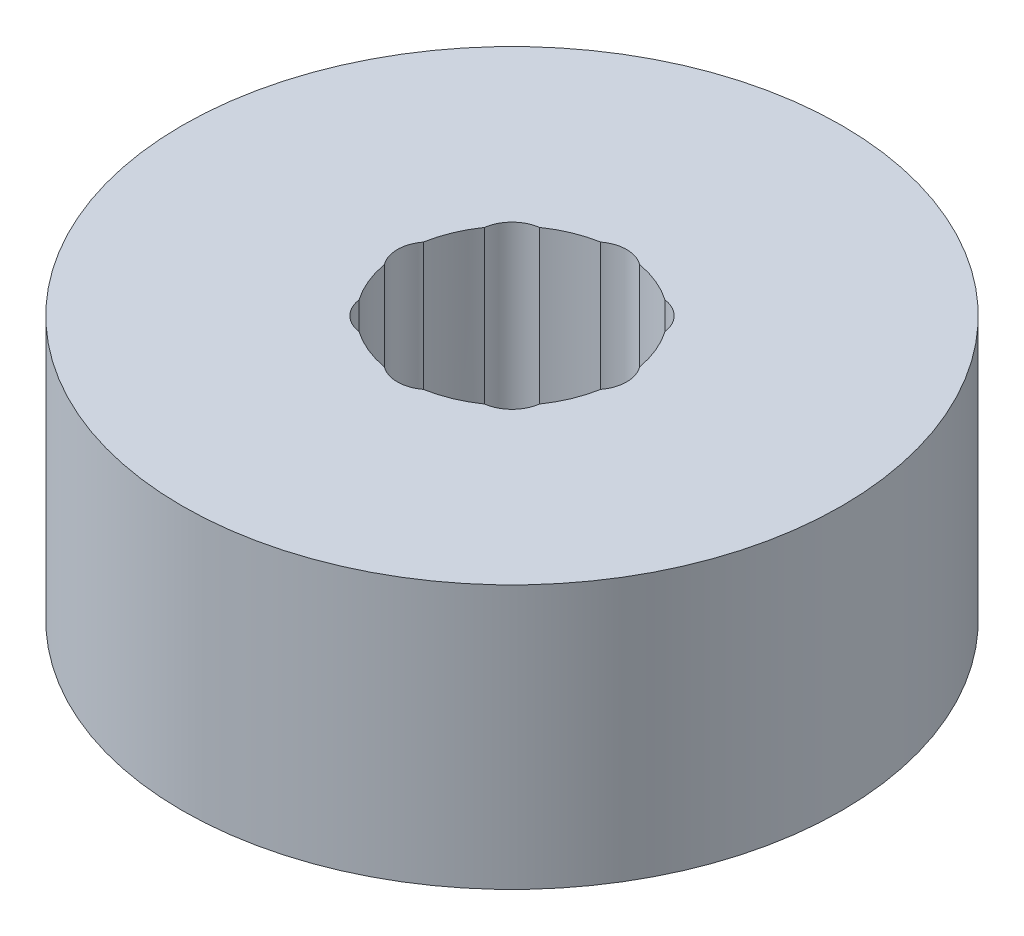
ISO-10303-21;
HEADER;
FILE_DESCRIPTION(('STEP AP214'),'2;1');
FILE_NAME('part.step','',(''),(''),'','','');
FILE_SCHEMA(('AUTOMOTIVE_DESIGN { 1 0 10303 214 1 1 1 1 }'));
ENDSEC;
DATA;
#1=APPLICATION_CONTEXT('core data for automotive mechanical design processes');
#2=APPLICATION_PROTOCOL_DEFINITION('international standard','automotive_design',2000,#1);
#3=PRODUCT_CONTEXT('',#1,'mechanical');
#4=PRODUCT('Part','Part','',(#3));
#5=PRODUCT_RELATED_PRODUCT_CATEGORY('part','',(#4));
#6=PRODUCT_DEFINITION_FORMATION('','',#4);
#7=PRODUCT_DEFINITION_CONTEXT('part definition',#1,'design');
#8=PRODUCT_DEFINITION('design','',#6,#7);
#9=PRODUCT_DEFINITION_SHAPE('','',#8);
#10=(LENGTH_UNIT() NAMED_UNIT(*) SI_UNIT(.MILLI.,.METRE.));
#11=(NAMED_UNIT(*) PLANE_ANGLE_UNIT() SI_UNIT($,.RADIAN.));
#12=(NAMED_UNIT(*) SI_UNIT($,.STERADIAN.) SOLID_ANGLE_UNIT());
#13=UNCERTAINTY_MEASURE_WITH_UNIT(LENGTH_MEASURE(1.E-05),#10,'distance_accuracy_value','');
#14=(GEOMETRIC_REPRESENTATION_CONTEXT(3) GLOBAL_UNCERTAINTY_ASSIGNED_CONTEXT((#13)) GLOBAL_UNIT_ASSIGNED_CONTEXT((#10,
#11,#12)) REPRESENTATION_CONTEXT('',''));
#15=CARTESIAN_POINT('',(0.,0.,0.));
#16=DIRECTION('',(0.,0.,1.));
#17=DIRECTION('',(1.,0.,0.));
#18=AXIS2_PLACEMENT_3D('',#15,#16,#17);
#19=CARTESIAN_POINT('',(0.,18.,0.));
#20=DIRECTION('',(0.,-1.,0.));
#21=DIRECTION('',(0.,0.,-1.));
#22=AXIS2_PLACEMENT_3D('',#19,#20,#21);
#23=CYLINDRICAL_SURFACE('',#22,22.5);
#24=CARTESIAN_POINT('',(0.,18.,0.));
#25=DIRECTION('',(0.,1.,0.));
#26=DIRECTION('',(0.,0.,1.));
#27=AXIS2_PLACEMENT_3D('',#24,#25,#26);
#28=CIRCLE('',#27,22.5);
#29=CARTESIAN_POINT('',(0.,18.,22.5));
#30=VERTEX_POINT('',#29);
#31=EDGE_CURVE('E263',#30,#30,#28,.T.);
#32=ORIENTED_EDGE('',*,*,#31,.F.);
#33=EDGE_LOOP('',(#32));
#34=FACE_BOUND('',#33,.T.);
#35=CARTESIAN_POINT('',(0.,0.,0.));
#36=DIRECTION('',(0.,1.,0.));
#37=DIRECTION('',(0.,0.,1.));
#38=AXIS2_PLACEMENT_3D('',#35,#36,#37);
#39=CIRCLE('',#38,22.5);
#40=CARTESIAN_POINT('',(0.,0.,22.5));
#41=VERTEX_POINT('',#40);
#42=EDGE_CURVE('E256',#41,#41,#39,.T.);
#43=ORIENTED_EDGE('',*,*,#42,.T.);
#44=EDGE_LOOP('',(#43));
#45=FACE_BOUND('',#44,.T.);
#46=ADVANCED_FACE('F39',(#34,#45),#23,.T.);
#47=CARTESIAN_POINT('',(0.,18.,0.));
#48=DIRECTION('',(0.,1.,0.));
#49=DIRECTION('',(0.,0.,1.));
#50=AXIS2_PLACEMENT_3D('',#47,#48,#49);
#51=PLANE('',#50);
#52=CARTESIAN_POINT('',(-3.97389094860852,18.,3.97389094860854));
#53=DIRECTION('',(0.,1.,0.));
#54=DIRECTION('',(0.707106781186549,0.,0.707106781186546));
#55=AXIS2_PLACEMENT_3D('',#52,#53,#54);
#56=CIRCLE('',#55,2.20637313933488);
#57=CARTESIAN_POINT('',(-6.15894220023802,18.,4.27988679454577));
#58=VERTEX_POINT('',#57);
#59=CARTESIAN_POINT('',(-4.27988679454575,18.,6.15894220023803));
#60=VERTEX_POINT('',#59);
#61=EDGE_CURVE('E246',#58,#60,#56,.T.);
#62=ORIENTED_EDGE('',*,*,#61,.F.);
#63=CARTESIAN_POINT('',(0.,18.,0.));
#64=DIRECTION('',(0.,1.,0.));
#65=DIRECTION('',(0.,0.,1.));
#66=AXIS2_PLACEMENT_3D('',#63,#64,#65);
#67=CIRCLE('',#66,7.5);
#68=CARTESIAN_POINT('',(-7.38136676985837,18.,1.32869281959024));
#69=VERTEX_POINT('',#68);
#70=EDGE_CURVE('E254',#69,#58,#67,.T.);
#71=ORIENTED_EDGE('',*,*,#70,.F.);
#72=CARTESIAN_POINT('',(-5.61993047491387,18.,0.));
#73=DIRECTION('',(0.,1.,0.));
#74=DIRECTION('',(0.,0.,1.));
#75=AXIS2_PLACEMENT_3D('',#72,#73,#74);
#76=CIRCLE('',#75,2.20637313933488);
#77=CARTESIAN_POINT('',(-7.38136676985837,18.,-1.32869281959024));
#78=VERTEX_POINT('',#77);
#79=EDGE_CURVE('E248',#78,#69,#76,.T.);
#80=ORIENTED_EDGE('',*,*,#79,.F.);
#81=CARTESIAN_POINT('',(-6.15894220023808,18.,-4.27988679454568));
#82=VERTEX_POINT('',#81);
#83=EDGE_CURVE('E257',#82,#78,#67,.T.);
#84=ORIENTED_EDGE('',*,*,#83,.F.);
#85=CARTESIAN_POINT('',(-3.97389094860858,18.,-3.97389094860848));
#86=DIRECTION('',(0.,1.,0.));
#87=DIRECTION('',(-0.707106781186539,0.,0.707106781186556));
#88=AXIS2_PLACEMENT_3D('',#85,#86,#87);
#89=CIRCLE('',#88,2.20637313933488);
#90=CARTESIAN_POINT('',(-4.27988679454583,18.,-6.15894220023797));
#91=VERTEX_POINT('',#90);
#92=EDGE_CURVE('E58',#91,#82,#89,.T.);
#93=ORIENTED_EDGE('',*,*,#92,.F.);
#94=CARTESIAN_POINT('',(-1.32869281959032,18.,-7.38136676985835));
#95=VERTEX_POINT('',#94);
#96=EDGE_CURVE('E168',#95,#91,#67,.T.);
#97=ORIENTED_EDGE('',*,*,#96,.F.);
#98=CARTESIAN_POINT('',(0.,18.,-5.61993047491387));
#99=DIRECTION('',(0.,1.,0.));
#100=DIRECTION('',(-1.,0.,0.));
#101=AXIS2_PLACEMENT_3D('',#98,#99,#100);
#102=CIRCLE('',#101,2.20637313933488);
#103=CARTESIAN_POINT('',(1.32869281959017,18.,-7.38136676985838));
#104=VERTEX_POINT('',#103);
#105=EDGE_CURVE('E165',#104,#95,#102,.T.);
#106=ORIENTED_EDGE('',*,*,#105,.F.);
#107=CARTESIAN_POINT('',(4.2798867945457,18.,-6.15894220023807));
#108=VERTEX_POINT('',#107);
#109=EDGE_CURVE('E604',#108,#104,#67,.T.);
#110=ORIENTED_EDGE('',*,*,#109,.F.);
#111=CARTESIAN_POINT('',(3.9738909486085,18.,-3.97389094860856));
#112=DIRECTION('',(0.,1.,0.));
#113=DIRECTION('',(-0.707106781186554,0.,-0.707106781186541));
#114=AXIS2_PLACEMENT_3D('',#111,#112,#113);
#115=CIRCLE('',#114,2.20637313933488);
#116=CARTESIAN_POINT('',(6.15894220023799,18.,-4.27988679454581));
#117=VERTEX_POINT('',#116);
#118=EDGE_CURVE('E224',#117,#108,#115,.T.);
#119=ORIENTED_EDGE('',*,*,#118,.F.);
#120=CARTESIAN_POINT('',(7.38136676985837,18.,-1.32869281959024));
#121=VERTEX_POINT('',#120);
#122=EDGE_CURVE('E605',#121,#117,#67,.T.);
#123=ORIENTED_EDGE('',*,*,#122,.F.);
#124=CARTESIAN_POINT('',(5.61993047491387,18.,0.));
#125=DIRECTION('',(0.,1.,0.));
#126=DIRECTION('',(0.,0.,-1.));
#127=AXIS2_PLACEMENT_3D('',#124,#125,#126);
#128=CIRCLE('',#127,2.20637313933488);
#129=CARTESIAN_POINT('',(7.38136676985836,18.,1.32869281959024));
#130=VERTEX_POINT('',#129);
#131=EDGE_CURVE('E231',#130,#121,#128,.T.);
#132=ORIENTED_EDGE('',*,*,#131,.F.);
#133=CARTESIAN_POINT('',(6.15894220023805,18.,4.27988679454573));
#134=VERTEX_POINT('',#133);
#135=EDGE_CURVE('E599',#134,#130,#67,.T.);
#136=ORIENTED_EDGE('',*,*,#135,.F.);
#137=CARTESIAN_POINT('',(3.97389094860855,18.,3.97389094860851));
#138=DIRECTION('',(0.,1.,0.));
#139=DIRECTION('',(0.707106781186544,0.,-0.707106781186551));
#140=AXIS2_PLACEMENT_3D('',#137,#138,#139);
#141=CIRCLE('',#140,2.20637313933488);
#142=CARTESIAN_POINT('',(4.27988679454579,18.,6.158942200238));
#143=VERTEX_POINT('',#142);
#144=EDGE_CURVE('E237',#143,#134,#141,.T.);
#145=ORIENTED_EDGE('',*,*,#144,.F.);
#146=CARTESIAN_POINT('',(1.32869281959027,18.,7.38136676985836));
#147=VERTEX_POINT('',#146);
#148=EDGE_CURVE('E598',#147,#143,#67,.T.);
#149=ORIENTED_EDGE('',*,*,#148,.F.);
#150=CARTESIAN_POINT('',(0.,18.,5.61993047491387));
#151=DIRECTION('',(0.,1.,0.));
#152=DIRECTION('',(1.,0.,0.));
#153=AXIS2_PLACEMENT_3D('',#150,#151,#152);
#154=CIRCLE('',#153,2.20637313933488);
#155=CARTESIAN_POINT('',(-1.32869281959022,18.,7.38136676985837));
#156=VERTEX_POINT('',#155);
#157=EDGE_CURVE('E241',#156,#147,#154,.T.);
#158=ORIENTED_EDGE('',*,*,#157,.F.);
#159=EDGE_CURVE('E259',#60,#156,#67,.T.);
#160=ORIENTED_EDGE('',*,*,#159,.F.);
#161=EDGE_LOOP('',(#62,#71,#80,#84,#93,#97,#106,#110,#119,#123,#132,#136,#145,#149,#158,#160));
#162=FACE_BOUND('',#161,.T.);
#163=ORIENTED_EDGE('',*,*,#31,.T.);
#164=EDGE_LOOP('',(#163));
#165=FACE_BOUND('',#164,.T.);
#166=ADVANCED_FACE('F286',(#162,#165),#51,.T.);
#167=CARTESIAN_POINT('',(0.,0.,0.));
#168=DIRECTION('',(0.,1.,0.));
#169=DIRECTION('',(0.,0.,1.));
#170=AXIS2_PLACEMENT_3D('',#167,#168,#169);
#171=PLANE('',#170);
#172=CARTESIAN_POINT('',(0.,0.,0.));
#173=DIRECTION('',(0.,1.,0.));
#174=DIRECTION('',(0.,0.,1.));
#175=AXIS2_PLACEMENT_3D('',#172,#173,#174);
#176=CIRCLE('',#175,7.5);
#177=CARTESIAN_POINT('',(0.,0.,7.5));
#178=VERTEX_POINT('',#177);
#179=EDGE_CURVE('E251',#178,#178,#176,.T.);
#180=ORIENTED_EDGE('',*,*,#179,.T.);
#181=EDGE_LOOP('',(#180));
#182=FACE_BOUND('',#181,.T.);
#183=ORIENTED_EDGE('',*,*,#42,.F.);
#184=EDGE_LOOP('',(#183));
#185=FACE_BOUND('',#184,.T.);
#186=ADVANCED_FACE('F308',(#182,#185),#171,.F.);
#187=CARTESIAN_POINT('',(0.,18.,0.));
#188=DIRECTION('',(0.,-1.,0.));
#189=DIRECTION('',(0.,0.,-1.));
#190=AXIS2_PLACEMENT_3D('',#187,#188,#189);
#191=CYLINDRICAL_SURFACE('',#190,7.5);
#192=DIRECTION('',(0.,1.,0.));
#193=VECTOR('',#192,1.);
#194=CARTESIAN_POINT('',(-6.15894220023802,11.003877804609,4.27988679454577));
#195=LINE('',#194,#193);
#196=CARTESIAN_POINT('',(-6.15894220023802,4.00775560921806,4.27988679454577));
#197=VERTEX_POINT('',#196);
#198=EDGE_CURVE('E11',#197,#58,#195,.T.);
#199=ORIENTED_EDGE('',*,*,#198,.F.);
#200=CARTESIAN_POINT('',(0.,4.00775560921806,0.));
#201=DIRECTION('',(0.,1.,0.));
#202=DIRECTION('',(0.,0.,1.));
#203=AXIS2_PLACEMENT_3D('',#200,#201,#202);
#204=CIRCLE('',#203,7.5);
#205=CARTESIAN_POINT('',(-4.27988679454575,4.00775560921806,6.15894220023803));
#206=VERTEX_POINT('',#205);
#207=EDGE_CURVE('E157',#197,#206,#204,.T.);
#208=ORIENTED_EDGE('',*,*,#207,.T.);
#209=DIRECTION('',(0.,1.,0.));
#210=VECTOR('',#209,1.);
#211=CARTESIAN_POINT('',(-4.27988679454575,11.003877804609,6.15894220023803));
#212=LINE('',#211,#210);
#213=EDGE_CURVE('E46',#60,#206,#212,.F.);
#214=ORIENTED_EDGE('',*,*,#213,.F.);
#215=ORIENTED_EDGE('',*,*,#159,.T.);
#216=DIRECTION('',(0.,1.,0.));
#217=VECTOR('',#216,1.);
#218=CARTESIAN_POINT('',(-1.32869281959022,11.003877804609,7.38136676985837));
#219=LINE('',#218,#217);
#220=CARTESIAN_POINT('',(-1.32869281959022,4.00775560921806,7.38136676985837));
#221=VERTEX_POINT('',#220);
#222=EDGE_CURVE('E198',#221,#156,#219,.T.);
#223=ORIENTED_EDGE('',*,*,#222,.F.);
#224=CARTESIAN_POINT('',(1.32869281959027,4.00775560921806,7.38136676985836));
#225=VERTEX_POINT('',#224);
#226=EDGE_CURVE('E194',#221,#225,#204,.T.);
#227=ORIENTED_EDGE('',*,*,#226,.T.);
#228=DIRECTION('',(0.,1.,0.));
#229=VECTOR('',#228,1.);
#230=CARTESIAN_POINT('',(1.32869281959027,11.003877804609,7.38136676985836));
#231=LINE('',#230,#229);
#232=EDGE_CURVE('E192',#147,#225,#231,.F.);
#233=ORIENTED_EDGE('',*,*,#232,.F.);
#234=ORIENTED_EDGE('',*,*,#148,.T.);
#235=DIRECTION('',(0.,1.,0.));
#236=VECTOR('',#235,1.);
#237=CARTESIAN_POINT('',(4.27988679454579,11.003877804609,6.158942200238));
#238=LINE('',#237,#236);
#239=CARTESIAN_POINT('',(4.27988679454579,4.00775560921806,6.158942200238));
#240=VERTEX_POINT('',#239);
#241=EDGE_CURVE('E191',#240,#143,#238,.T.);
#242=ORIENTED_EDGE('',*,*,#241,.F.);
#243=CARTESIAN_POINT('',(6.15894220023805,4.00775560921806,4.27988679454573));
#244=VERTEX_POINT('',#243);
#245=EDGE_CURVE('E189',#240,#244,#204,.T.);
#246=ORIENTED_EDGE('',*,*,#245,.T.);
#247=DIRECTION('',(0.,1.,0.));
#248=VECTOR('',#247,1.);
#249=CARTESIAN_POINT('',(6.15894220023805,11.003877804609,4.27988679454572));
#250=LINE('',#249,#248);
#251=EDGE_CURVE('E187',#134,#244,#250,.F.);
#252=ORIENTED_EDGE('',*,*,#251,.F.);
#253=ORIENTED_EDGE('',*,*,#135,.T.);
#254=DIRECTION('',(0.,1.,0.));
#255=VECTOR('',#254,1.);
#256=CARTESIAN_POINT('',(7.38136676985836,11.003877804609,1.32869281959024));
#257=LINE('',#256,#255);
#258=CARTESIAN_POINT('',(7.38136676985836,4.00775560921806,1.32869281959024));
#259=VERTEX_POINT('',#258);
#260=EDGE_CURVE('E186',#259,#130,#257,.T.);
#261=ORIENTED_EDGE('',*,*,#260,.F.);
#262=CARTESIAN_POINT('',(7.38136676985836,4.00775560921806,-1.32869281959024));
#263=VERTEX_POINT('',#262);
#264=EDGE_CURVE('E183',#259,#263,#204,.T.);
#265=ORIENTED_EDGE('',*,*,#264,.T.);
#266=DIRECTION('',(0.,1.,0.));
#267=VECTOR('',#266,1.);
#268=CARTESIAN_POINT('',(7.38136676985836,11.003877804609,-1.32869281959024));
#269=LINE('',#268,#267);
#270=EDGE_CURVE('E181',#121,#263,#269,.F.);
#271=ORIENTED_EDGE('',*,*,#270,.F.);
#272=ORIENTED_EDGE('',*,*,#122,.T.);
#273=DIRECTION('',(0.,1.,0.));
#274=VECTOR('',#273,1.);
#275=CARTESIAN_POINT('',(6.15894220023799,11.003877804609,-4.27988679454581));
#276=LINE('',#275,#274);
#277=CARTESIAN_POINT('',(6.15894220023799,4.00775560921806,-4.27988679454581));
#278=VERTEX_POINT('',#277);
#279=EDGE_CURVE('E182',#278,#117,#276,.T.);
#280=ORIENTED_EDGE('',*,*,#279,.F.);
#281=CARTESIAN_POINT('',(4.2798867945457,4.00775560921806,-6.15894220023806));
#282=VERTEX_POINT('',#281);
#283=EDGE_CURVE('E179',#278,#282,#204,.T.);
#284=ORIENTED_EDGE('',*,*,#283,.T.);
#285=DIRECTION('',(0.,1.,0.));
#286=VECTOR('',#285,1.);
#287=CARTESIAN_POINT('',(4.2798867945457,11.003877804609,-6.15894220023806));
#288=LINE('',#287,#286);
#289=EDGE_CURVE('E177',#108,#282,#288,.F.);
#290=ORIENTED_EDGE('',*,*,#289,.F.);
#291=ORIENTED_EDGE('',*,*,#109,.T.);
#292=DIRECTION('',(0.,1.,0.));
#293=VECTOR('',#292,1.);
#294=CARTESIAN_POINT('',(1.32869281959017,11.003877804609,-7.38136676985838));
#295=LINE('',#294,#293);
#296=CARTESIAN_POINT('',(1.32869281959017,4.00775560921806,-7.38136676985838));
#297=VERTEX_POINT('',#296);
#298=EDGE_CURVE('E176',#297,#104,#295,.T.);
#299=ORIENTED_EDGE('',*,*,#298,.F.);
#300=CARTESIAN_POINT('',(-1.32869281959032,4.00775560921806,-7.38136676985835));
#301=VERTEX_POINT('',#300);
#302=EDGE_CURVE('E159',#297,#301,#204,.T.);
#303=ORIENTED_EDGE('',*,*,#302,.T.);
#304=DIRECTION('',(0.,1.,0.));
#305=VECTOR('',#304,1.);
#306=CARTESIAN_POINT('',(-1.32869281959032,11.003877804609,-7.38136676985835));
#307=LINE('',#306,#305);
#308=EDGE_CURVE('E171',#95,#301,#307,.F.);
#309=ORIENTED_EDGE('',*,*,#308,.F.);
#310=ORIENTED_EDGE('',*,*,#96,.T.);
#311=DIRECTION('',(0.,1.,0.));
#312=VECTOR('',#311,1.);
#313=CARTESIAN_POINT('',(-4.27988679454583,11.003877804609,-6.15894220023797));
#314=LINE('',#313,#312);
#315=CARTESIAN_POINT('',(-4.27988679454583,4.00775560921806,-6.15894220023797));
#316=VERTEX_POINT('',#315);
#317=EDGE_CURVE('E156',#316,#91,#314,.T.);
#318=ORIENTED_EDGE('',*,*,#317,.F.);
#319=CARTESIAN_POINT('',(-6.15894220023808,4.00775560921806,-4.27988679454568));
#320=VERTEX_POINT('',#319);
#321=EDGE_CURVE('E147',#316,#320,#204,.T.);
#322=ORIENTED_EDGE('',*,*,#321,.T.);
#323=DIRECTION('',(0.,1.,0.));
#324=VECTOR('',#323,1.);
#325=CARTESIAN_POINT('',(-6.15894220023808,11.003877804609,-4.27988679454568));
#326=LINE('',#325,#324);
#327=EDGE_CURVE('E160',#82,#320,#326,.F.);
#328=ORIENTED_EDGE('',*,*,#327,.F.);
#329=ORIENTED_EDGE('',*,*,#83,.T.);
#330=DIRECTION('',(0.,1.,0.));
#331=VECTOR('',#330,1.);
#332=CARTESIAN_POINT('',(-7.38136676985836,11.003877804609,-1.32869281959024));
#333=LINE('',#332,#331);
#334=CARTESIAN_POINT('',(-7.38136676985837,4.00775560921806,-1.32869281959024));
#335=VERTEX_POINT('',#334);
#336=EDGE_CURVE('E273',#335,#78,#333,.T.);
#337=ORIENTED_EDGE('',*,*,#336,.F.);
#338=CARTESIAN_POINT('',(0.,4.00775560921806,0.));
#339=DIRECTION('',(0.,1.,0.));
#340=DIRECTION('',(0.,0.,1.));
#341=AXIS2_PLACEMENT_3D('',#338,#339,#340);
#342=CIRCLE('',#341,7.5);
#343=CARTESIAN_POINT('',(-7.38136676985837,4.00775560921806,1.32869281959024));
#344=VERTEX_POINT('',#343);
#345=EDGE_CURVE('E266',#335,#344,#342,.T.);
#346=ORIENTED_EDGE('',*,*,#345,.T.);
#347=DIRECTION('',(0.,1.,0.));
#348=VECTOR('',#347,1.);
#349=CARTESIAN_POINT('',(-7.38136676985836,11.003877804609,1.32869281959024));
#350=LINE('',#349,#348);
#351=EDGE_CURVE('E271',#69,#344,#350,.F.);
#352=ORIENTED_EDGE('',*,*,#351,.F.);
#353=ORIENTED_EDGE('',*,*,#70,.T.);
#354=EDGE_LOOP('',(#199,#208,#214,#215,#223,#227,#233,#234,#242,#246,#252,#253,#261,#265,#271,
#272,#280,#284,#290,#291,#299,#303,#309,#310,#318,#322,#328,#329,#337,#346,#352,#353));
#355=FACE_BOUND('',#354,.T.);
#356=ORIENTED_EDGE('',*,*,#179,.F.);
#357=EDGE_LOOP('',(#356));
#358=FACE_BOUND('',#357,.T.);
#359=ADVANCED_FACE('F167',(#355,#358),#191,.F.);
#360=CARTESIAN_POINT('',(-5.61993047491387,4.00775560921806,0.));
#361=DIRECTION('',(0.,1.,0.));
#362=DIRECTION('',(0.,0.,1.));
#363=AXIS2_PLACEMENT_3D('',#360,#361,#362);
#364=CYLINDRICAL_SURFACE('',#363,2.20637313933488);
#365=ORIENTED_EDGE('',*,*,#336,.T.);
#366=ORIENTED_EDGE('',*,*,#79,.T.);
#367=ORIENTED_EDGE('',*,*,#351,.T.);
#368=CARTESIAN_POINT('',(-5.61993047491387,4.00775560921806,0.));
#369=DIRECTION('',(0.,1.,0.));
#370=DIRECTION('',(0.,0.,1.));
#371=AXIS2_PLACEMENT_3D('',#368,#369,#370);
#372=CIRCLE('',#371,2.20637313933488);
#373=EDGE_CURVE('E253',#335,#344,#372,.T.);
#374=ORIENTED_EDGE('',*,*,#373,.F.);
#375=EDGE_LOOP('',(#365,#366,#367,#374));
#376=FACE_BOUND('',#375,.T.);
#377=ADVANCED_FACE('F278',(#376),#364,.F.);
#378=CARTESIAN_POINT('',(-5.61993047491387,4.00775560921806,0.));
#379=DIRECTION('',(0.,1.,0.));
#380=DIRECTION('',(0.,0.,1.));
#381=AXIS2_PLACEMENT_3D('',#378,#379,#380);
#382=PLANE('',#381);
#383=ORIENTED_EDGE('',*,*,#373,.T.);
#384=ORIENTED_EDGE('',*,*,#345,.F.);
#385=EDGE_LOOP('',(#383,#384));
#386=FACE_BOUND('',#385,.T.);
#387=ADVANCED_FACE('F289',(#386),#382,.T.);
#388=CARTESIAN_POINT('',(-3.97389094860858,4.00775560921806,-3.97389094860848));
#389=DIRECTION('',(0.,1.,0.));
#390=DIRECTION('',(0.,0.,1.));
#391=AXIS2_PLACEMENT_3D('',#388,#389,#390);
#392=CYLINDRICAL_SURFACE('',#391,2.20637313933488);
#393=ORIENTED_EDGE('',*,*,#317,.T.);
#394=ORIENTED_EDGE('',*,*,#92,.T.);
#395=ORIENTED_EDGE('',*,*,#327,.T.);
#396=CARTESIAN_POINT('',(-3.97389094860858,4.00775560921806,-3.97389094860848));
#397=DIRECTION('',(0.,1.,0.));
#398=DIRECTION('',(-0.707106781186539,0.,0.707106781186556));
#399=AXIS2_PLACEMENT_3D('',#396,#397,#398);
#400=CIRCLE('',#399,2.20637313933488);
#401=EDGE_CURVE('E153',#316,#320,#400,.T.);
#402=ORIENTED_EDGE('',*,*,#401,.F.);
#403=EDGE_LOOP('',(#393,#394,#395,#402));
#404=FACE_BOUND('',#403,.T.);
#405=ADVANCED_FACE('F161',(#404),#392,.F.);
#406=CARTESIAN_POINT('',(-3.97389094860852,4.00775560921806,3.97389094860854));
#407=DIRECTION('',(0.,1.,0.));
#408=DIRECTION('',(0.707106781186549,0.,0.707106781186546));
#409=AXIS2_PLACEMENT_3D('',#406,#407,#408);
#410=PLANE('',#409);
#411=ORIENTED_EDGE('',*,*,#401,.T.);
#412=ORIENTED_EDGE('',*,*,#321,.F.);
#413=EDGE_LOOP('',(#411,#412));
#414=FACE_BOUND('',#413,.T.);
#415=ADVANCED_FACE('F155',(#414),#410,.T.);
#416=CARTESIAN_POINT('',(0.,4.00775560921806,-5.61993047491387));
#417=DIRECTION('',(0.,1.,0.));
#418=DIRECTION('',(0.,0.,1.));
#419=AXIS2_PLACEMENT_3D('',#416,#417,#418);
#420=CYLINDRICAL_SURFACE('',#419,2.20637313933488);
#421=ORIENTED_EDGE('',*,*,#298,.T.);
#422=ORIENTED_EDGE('',*,*,#105,.T.);
#423=ORIENTED_EDGE('',*,*,#308,.T.);
#424=CARTESIAN_POINT('',(0.,4.00775560921806,-5.61993047491387));
#425=DIRECTION('',(0.,1.,0.));
#426=DIRECTION('',(-1.,0.,0.));
#427=AXIS2_PLACEMENT_3D('',#424,#425,#426);
#428=CIRCLE('',#427,2.20637313933488);
#429=EDGE_CURVE('E218',#297,#301,#428,.T.);
#430=ORIENTED_EDGE('',*,*,#429,.F.);
#431=EDGE_LOOP('',(#421,#422,#423,#430));
#432=FACE_BOUND('',#431,.T.);
#433=ADVANCED_FACE('F222',(#432),#420,.F.);
#434=ORIENTED_EDGE('',*,*,#429,.T.);
#435=ORIENTED_EDGE('',*,*,#302,.F.);
#436=EDGE_LOOP('',(#434,#435));
#437=FACE_BOUND('',#436,.T.);
#438=ADVANCED_FACE('F217',(#437),#410,.T.);
#439=CARTESIAN_POINT('',(3.9738909486085,4.00775560921806,-3.97389094860856));
#440=DIRECTION('',(0.,1.,0.));
#441=DIRECTION('',(0.,0.,1.));
#442=AXIS2_PLACEMENT_3D('',#439,#440,#441);
#443=CYLINDRICAL_SURFACE('',#442,2.20637313933488);
#444=ORIENTED_EDGE('',*,*,#279,.T.);
#445=ORIENTED_EDGE('',*,*,#118,.T.);
#446=ORIENTED_EDGE('',*,*,#289,.T.);
#447=CARTESIAN_POINT('',(3.9738909486085,4.00775560921806,-3.97389094860856));
#448=DIRECTION('',(0.,1.,0.));
#449=DIRECTION('',(-0.707106781186554,0.,-0.707106781186541));
#450=AXIS2_PLACEMENT_3D('',#447,#448,#449);
#451=CIRCLE('',#450,2.20637313933488);
#452=EDGE_CURVE('E223',#278,#282,#451,.T.);
#453=ORIENTED_EDGE('',*,*,#452,.F.);
#454=EDGE_LOOP('',(#444,#445,#446,#453));
#455=FACE_BOUND('',#454,.T.);
#456=ADVANCED_FACE('F355',(#455),#443,.F.);
#457=ORIENTED_EDGE('',*,*,#452,.T.);
#458=ORIENTED_EDGE('',*,*,#283,.F.);
#459=EDGE_LOOP('',(#457,#458));
#460=FACE_BOUND('',#459,.T.);
#461=ADVANCED_FACE('F352',(#460),#410,.T.);
#462=CARTESIAN_POINT('',(5.61993047491387,4.00775560921806,0.));
#463=DIRECTION('',(0.,1.,0.));
#464=DIRECTION('',(0.,0.,1.));
#465=AXIS2_PLACEMENT_3D('',#462,#463,#464);
#466=CYLINDRICAL_SURFACE('',#465,2.20637313933488);
#467=ORIENTED_EDGE('',*,*,#260,.T.);
#468=ORIENTED_EDGE('',*,*,#131,.T.);
#469=ORIENTED_EDGE('',*,*,#270,.T.);
#470=CARTESIAN_POINT('',(5.61993047491387,4.00775560921806,0.));
#471=DIRECTION('',(0.,1.,0.));
#472=DIRECTION('',(0.,0.,-1.));
#473=AXIS2_PLACEMENT_3D('',#470,#471,#472);
#474=CIRCLE('',#473,2.20637313933488);
#475=EDGE_CURVE('E232',#259,#263,#474,.T.);
#476=ORIENTED_EDGE('',*,*,#475,.F.);
#477=EDGE_LOOP('',(#467,#468,#469,#476));
#478=FACE_BOUND('',#477,.T.);
#479=ADVANCED_FACE('F369',(#478),#466,.F.);
#480=ORIENTED_EDGE('',*,*,#475,.T.);
#481=ORIENTED_EDGE('',*,*,#264,.F.);
#482=EDGE_LOOP('',(#480,#481));
#483=FACE_BOUND('',#482,.T.);
#484=ADVANCED_FACE('F371',(#483),#410,.T.);
#485=CARTESIAN_POINT('',(3.97389094860855,4.00775560921806,3.97389094860851));
#486=DIRECTION('',(0.,1.,0.));
#487=DIRECTION('',(0.,0.,1.));
#488=AXIS2_PLACEMENT_3D('',#485,#486,#487);
#489=CYLINDRICAL_SURFACE('',#488,2.20637313933488);
#490=ORIENTED_EDGE('',*,*,#241,.T.);
#491=ORIENTED_EDGE('',*,*,#144,.T.);
#492=ORIENTED_EDGE('',*,*,#251,.T.);
#493=CARTESIAN_POINT('',(3.97389094860855,4.00775560921806,3.97389094860851));
#494=DIRECTION('',(0.,1.,0.));
#495=DIRECTION('',(0.707106781186544,0.,-0.707106781186551));
#496=AXIS2_PLACEMENT_3D('',#493,#494,#495);
#497=CIRCLE('',#496,2.20637313933488);
#498=EDGE_CURVE('E236',#240,#244,#497,.T.);
#499=ORIENTED_EDGE('',*,*,#498,.F.);
#500=EDGE_LOOP('',(#490,#491,#492,#499));
#501=FACE_BOUND('',#500,.T.);
#502=ADVANCED_FACE('F390',(#501),#489,.F.);
#503=ORIENTED_EDGE('',*,*,#498,.T.);
#504=ORIENTED_EDGE('',*,*,#245,.F.);
#505=EDGE_LOOP('',(#503,#504));
#506=FACE_BOUND('',#505,.T.);
#507=ADVANCED_FACE('F386',(#506),#410,.T.);
#508=CARTESIAN_POINT('',(0.,4.00775560921806,5.61993047491387));
#509=DIRECTION('',(0.,1.,0.));
#510=DIRECTION('',(0.,0.,1.));
#511=AXIS2_PLACEMENT_3D('',#508,#509,#510);
#512=CYLINDRICAL_SURFACE('',#511,2.20637313933488);
#513=ORIENTED_EDGE('',*,*,#222,.T.);
#514=ORIENTED_EDGE('',*,*,#157,.T.);
#515=ORIENTED_EDGE('',*,*,#232,.T.);
#516=CARTESIAN_POINT('',(0.,4.00775560921806,5.61993047491387));
#517=DIRECTION('',(0.,1.,0.));
#518=DIRECTION('',(1.,0.,0.));
#519=AXIS2_PLACEMENT_3D('',#516,#517,#518);
#520=CIRCLE('',#519,2.20637313933488);
#521=EDGE_CURVE('E242',#221,#225,#520,.T.);
#522=ORIENTED_EDGE('',*,*,#521,.F.);
#523=EDGE_LOOP('',(#513,#514,#515,#522));
#524=FACE_BOUND('',#523,.T.);
#525=ADVANCED_FACE('F403',(#524),#512,.F.);
#526=ORIENTED_EDGE('',*,*,#521,.T.);
#527=ORIENTED_EDGE('',*,*,#226,.F.);
#528=EDGE_LOOP('',(#526,#527));
#529=FACE_BOUND('',#528,.T.);
#530=ADVANCED_FACE('F410',(#529),#410,.T.);
#531=CARTESIAN_POINT('',(-3.97389094860852,4.00775560921806,3.97389094860854));
#532=DIRECTION('',(0.,1.,0.));
#533=DIRECTION('',(0.707106781186549,0.,0.707106781186546));
#534=AXIS2_PLACEMENT_3D('',#531,#532,#533);
#535=CIRCLE('',#534,2.20637313933488);
#536=EDGE_CURVE('E55',#197,#206,#535,.T.);
#537=ORIENTED_EDGE('',*,*,#536,.T.);
#538=ORIENTED_EDGE('',*,*,#207,.F.);
#539=EDGE_LOOP('',(#537,#538));
#540=FACE_BOUND('',#539,.T.);
#541=ADVANCED_FACE('F340',(#540),#410,.T.);
#542=CARTESIAN_POINT('',(-3.97389094860852,4.00775560921806,3.97389094860854));
#543=DIRECTION('',(0.,1.,0.));
#544=DIRECTION('',(0.,0.,1.));
#545=AXIS2_PLACEMENT_3D('',#542,#543,#544);
#546=CYLINDRICAL_SURFACE('',#545,2.20637313933488);
#547=ORIENTED_EDGE('',*,*,#198,.T.);
#548=ORIENTED_EDGE('',*,*,#61,.T.);
#549=ORIENTED_EDGE('',*,*,#213,.T.);
#550=ORIENTED_EDGE('',*,*,#536,.F.);
#551=EDGE_LOOP('',(#547,#548,#549,#550));
#552=FACE_BOUND('',#551,.T.);
#553=ADVANCED_FACE('F431',(#552),#546,.F.);
#554=CLOSED_SHELL('',(#46,#166,#186,#359,#377,#387,#405,#415,#433,#438,#456,#461,#479,#484,#502,
#507,#525,#530,#541,#553));
#555=MANIFOLD_SOLID_BREP('B2',#554);
#556=ADVANCED_BREP_SHAPE_REPRESENTATION('',(#18,#555),#14);
#557=SHAPE_DEFINITION_REPRESENTATION(#9,#556);
ENDSEC;
END-ISO-10303-21;
